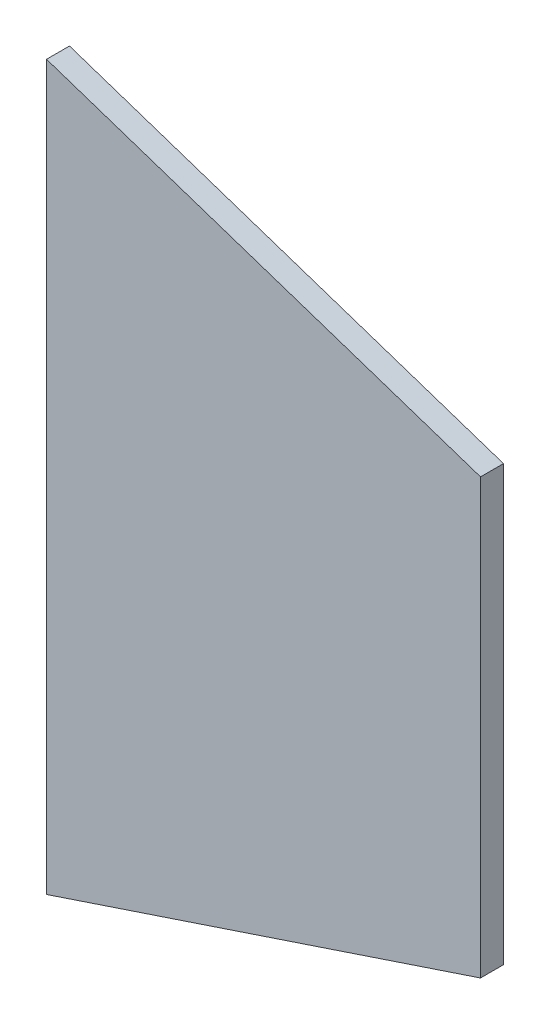
ISO-10303-21;
HEADER;
FILE_DESCRIPTION(('STEP AP214'),'2;1');
FILE_NAME('part.step','',(''),(''),'','','');
FILE_SCHEMA(('AUTOMOTIVE_DESIGN { 1 0 10303 214 1 1 1 1 }'));
ENDSEC;
DATA;
#1=APPLICATION_CONTEXT('core data for automotive mechanical design processes');
#2=APPLICATION_PROTOCOL_DEFINITION('international standard','automotive_design',2000,#1);
#3=PRODUCT_CONTEXT('',#1,'mechanical');
#4=PRODUCT('Part','Part','',(#3));
#5=PRODUCT_RELATED_PRODUCT_CATEGORY('part','',(#4));
#6=PRODUCT_DEFINITION_FORMATION('','',#4);
#7=PRODUCT_DEFINITION_CONTEXT('part definition',#1,'design');
#8=PRODUCT_DEFINITION('design','',#6,#7);
#9=PRODUCT_DEFINITION_SHAPE('','',#8);
#10=(LENGTH_UNIT() NAMED_UNIT(*) SI_UNIT(.MILLI.,.METRE.));
#11=(NAMED_UNIT(*) PLANE_ANGLE_UNIT() SI_UNIT($,.RADIAN.));
#12=(NAMED_UNIT(*) SI_UNIT($,.STERADIAN.) SOLID_ANGLE_UNIT());
#13=UNCERTAINTY_MEASURE_WITH_UNIT(LENGTH_MEASURE(1.E-05),#10,'distance_accuracy_value','');
#14=(GEOMETRIC_REPRESENTATION_CONTEXT(3) GLOBAL_UNCERTAINTY_ASSIGNED_CONTEXT((#13)) GLOBAL_UNIT_ASSIGNED_CONTEXT((#10,
#11,#12)) REPRESENTATION_CONTEXT('',''));
#15=CARTESIAN_POINT('',(0.,0.,0.));
#16=DIRECTION('',(0.,0.,1.));
#17=DIRECTION('',(1.,0.,0.));
#18=AXIS2_PLACEMENT_3D('',#15,#16,#17);
#19=CARTESIAN_POINT('',(95.2500000000001,127.,-4.03225));
#20=DIRECTION('',(0.316227766016838,0.948683298050514,0.));
#21=DIRECTION('',(-0.948683298050514,0.316227766016838,0.));
#22=AXIS2_PLACEMENT_3D('',#19,#20,#21);
#23=PLANE('',#22);
#24=DIRECTION('',(0.,0.,1.));
#25=VECTOR('',#24,1.);
#26=CARTESIAN_POINT('',(95.2500000000001,127.,-4.03225));
#27=LINE('',#26,#25);
#28=CARTESIAN_POINT('',(95.2500000000001,127.,-4.03225));
#29=VERTEX_POINT('',#28);
#30=CARTESIAN_POINT('',(95.2500000000001,127.,4.03225));
#31=VERTEX_POINT('',#30);
#32=EDGE_CURVE('E36',#29,#31,#27,.T.);
#33=ORIENTED_EDGE('',*,*,#32,.T.);
#34=DIRECTION('',(-0.948683298050514,0.316227766016838,0.));
#35=VECTOR('',#34,1.);
#36=CARTESIAN_POINT('',(95.2500000000001,127.,4.03225));
#37=LINE('',#36,#35);
#38=CARTESIAN_POINT('',(247.65,76.2,4.03225));
#39=VERTEX_POINT('',#38);
#40=EDGE_CURVE('E73',#39,#31,#37,.T.);
#41=ORIENTED_EDGE('',*,*,#40,.F.);
#42=DIRECTION('',(0.,0.,1.));
#43=VECTOR('',#42,1.);
#44=CARTESIAN_POINT('',(247.65,76.2,-4.03225));
#45=LINE('',#44,#43);
#46=CARTESIAN_POINT('',(247.65,76.2,-4.03225));
#47=VERTEX_POINT('',#46);
#48=EDGE_CURVE('E11',#47,#39,#45,.T.);
#49=ORIENTED_EDGE('',*,*,#48,.F.);
#50=DIRECTION('',(-0.948683298050514,0.316227766016838,0.));
#51=VECTOR('',#50,1.);
#52=CARTESIAN_POINT('',(95.2500000000001,127.,-4.03225));
#53=LINE('',#52,#51);
#54=EDGE_CURVE('E74',#47,#29,#53,.T.);
#55=ORIENTED_EDGE('',*,*,#54,.T.);
#56=EDGE_LOOP('',(#33,#41,#49,#55));
#57=FACE_BOUND('',#56,.T.);
#58=ADVANCED_FACE('F33',(#57),#23,.T.);
#59=CARTESIAN_POINT('',(247.65,76.2,-4.03225));
#60=DIRECTION('',(1.,0.,0.));
#61=DIRECTION('',(0.,0.,-1.));
#62=AXIS2_PLACEMENT_3D('',#59,#60,#61);
#63=PLANE('',#62);
#64=ORIENTED_EDGE('',*,*,#48,.T.);
#65=DIRECTION('',(0.,1.,0.));
#66=VECTOR('',#65,1.);
#67=CARTESIAN_POINT('',(247.65,76.2,4.03225));
#68=LINE('',#67,#66);
#69=CARTESIAN_POINT('',(247.65,-76.2,4.03225));
#70=VERTEX_POINT('',#69);
#71=EDGE_CURVE('E90',#70,#39,#68,.T.);
#72=ORIENTED_EDGE('',*,*,#71,.F.);
#73=DIRECTION('',(0.,0.,1.));
#74=VECTOR('',#73,1.);
#75=CARTESIAN_POINT('',(247.65,-76.2,-4.03225));
#76=LINE('',#75,#74);
#77=CARTESIAN_POINT('',(247.65,-76.2,-4.03225));
#78=VERTEX_POINT('',#77);
#79=EDGE_CURVE('E41',#78,#70,#76,.T.);
#80=ORIENTED_EDGE('',*,*,#79,.F.);
#81=DIRECTION('',(0.,1.,0.));
#82=VECTOR('',#81,1.);
#83=CARTESIAN_POINT('',(247.65,76.2,-4.03225));
#84=LINE('',#83,#82);
#85=EDGE_CURVE('E79',#78,#47,#84,.T.);
#86=ORIENTED_EDGE('',*,*,#85,.T.);
#87=EDGE_LOOP('',(#64,#72,#80,#86));
#88=FACE_BOUND('',#87,.T.);
#89=ADVANCED_FACE('F105',(#88),#63,.T.);
#90=CARTESIAN_POINT('',(95.2500000000001,-127.,-4.03225));
#91=DIRECTION('',(0.316227766016838,-0.948683298050514,0.));
#92=DIRECTION('',(0.948683298050514,0.316227766016838,0.));
#93=AXIS2_PLACEMENT_3D('',#90,#91,#92);
#94=PLANE('',#93);
#95=ORIENTED_EDGE('',*,*,#79,.T.);
#96=DIRECTION('',(0.948683298050514,0.316227766016838,0.));
#97=VECTOR('',#96,1.);
#98=CARTESIAN_POINT('',(95.2500000000001,-127.,4.03225));
#99=LINE('',#98,#97);
#100=CARTESIAN_POINT('',(95.2500000000001,-127.,4.03225));
#101=VERTEX_POINT('',#100);
#102=EDGE_CURVE('E86',#101,#70,#99,.T.);
#103=ORIENTED_EDGE('',*,*,#102,.F.);
#104=DIRECTION('',(0.,0.,1.));
#105=VECTOR('',#104,1.);
#106=CARTESIAN_POINT('',(95.2500000000001,-127.,-4.03225));
#107=LINE('',#106,#105);
#108=CARTESIAN_POINT('',(95.2500000000001,-127.,-4.03225));
#109=VERTEX_POINT('',#108);
#110=EDGE_CURVE('E78',#109,#101,#107,.T.);
#111=ORIENTED_EDGE('',*,*,#110,.F.);
#112=DIRECTION('',(0.948683298050514,0.316227766016838,0.));
#113=VECTOR('',#112,1.);
#114=CARTESIAN_POINT('',(95.2500000000001,-127.,-4.03225));
#115=LINE('',#114,#113);
#116=EDGE_CURVE('E98',#109,#78,#115,.T.);
#117=ORIENTED_EDGE('',*,*,#116,.T.);
#118=EDGE_LOOP('',(#95,#103,#111,#117));
#119=FACE_BOUND('',#118,.T.);
#120=ADVANCED_FACE('F102',(#119),#94,.T.);
#121=CARTESIAN_POINT('',(95.2500000000001,127.,-4.03225));
#122=DIRECTION('',(-1.,0.,0.));
#123=DIRECTION('',(0.,0.,1.));
#124=AXIS2_PLACEMENT_3D('',#121,#122,#123);
#125=PLANE('',#124);
#126=ORIENTED_EDGE('',*,*,#110,.T.);
#127=DIRECTION('',(0.,-1.,0.));
#128=VECTOR('',#127,1.);
#129=CARTESIAN_POINT('',(95.2500000000001,127.,4.03225));
#130=LINE('',#129,#128);
#131=EDGE_CURVE('E81',#31,#101,#130,.T.);
#132=ORIENTED_EDGE('',*,*,#131,.F.);
#133=ORIENTED_EDGE('',*,*,#32,.F.);
#134=DIRECTION('',(0.,-1.,0.));
#135=VECTOR('',#134,1.);
#136=CARTESIAN_POINT('',(95.2500000000001,127.,-4.03225));
#137=LINE('',#136,#135);
#138=EDGE_CURVE('E96',#29,#109,#137,.T.);
#139=ORIENTED_EDGE('',*,*,#138,.T.);
#140=EDGE_LOOP('',(#126,#132,#133,#139));
#141=FACE_BOUND('',#140,.T.);
#142=ADVANCED_FACE('F82',(#141),#125,.T.);
#143=CARTESIAN_POINT('',(0.,0.,-4.03225));
#144=DIRECTION('',(0.,0.,-1.));
#145=DIRECTION('',(-1.,0.,0.));
#146=AXIS2_PLACEMENT_3D('',#143,#144,#145);
#147=PLANE('',#146);
#148=ORIENTED_EDGE('',*,*,#54,.F.);
#149=ORIENTED_EDGE('',*,*,#85,.F.);
#150=ORIENTED_EDGE('',*,*,#116,.F.);
#151=ORIENTED_EDGE('',*,*,#138,.F.);
#152=EDGE_LOOP('',(#148,#149,#150,#151));
#153=FACE_BOUND('',#152,.T.);
#154=ADVANCED_FACE('F107',(#153),#147,.T.);
#155=CARTESIAN_POINT('',(0.,0.,4.03225));
#156=DIRECTION('',(0.,0.,-1.));
#157=DIRECTION('',(-1.,0.,0.));
#158=AXIS2_PLACEMENT_3D('',#155,#156,#157);
#159=PLANE('',#158);
#160=ORIENTED_EDGE('',*,*,#40,.T.);
#161=ORIENTED_EDGE('',*,*,#131,.T.);
#162=ORIENTED_EDGE('',*,*,#102,.T.);
#163=ORIENTED_EDGE('',*,*,#71,.T.);
#164=EDGE_LOOP('',(#160,#161,#162,#163));
#165=FACE_BOUND('',#164,.T.);
#166=ADVANCED_FACE('F89',(#165),#159,.F.);
#167=CLOSED_SHELL('',(#58,#89,#120,#142,#154,#166));
#168=MANIFOLD_SOLID_BREP('B2',#167);
#169=ADVANCED_BREP_SHAPE_REPRESENTATION('',(#18,#168),#14);
#170=SHAPE_DEFINITION_REPRESENTATION(#9,#169);
ENDSEC;
END-ISO-10303-21;
